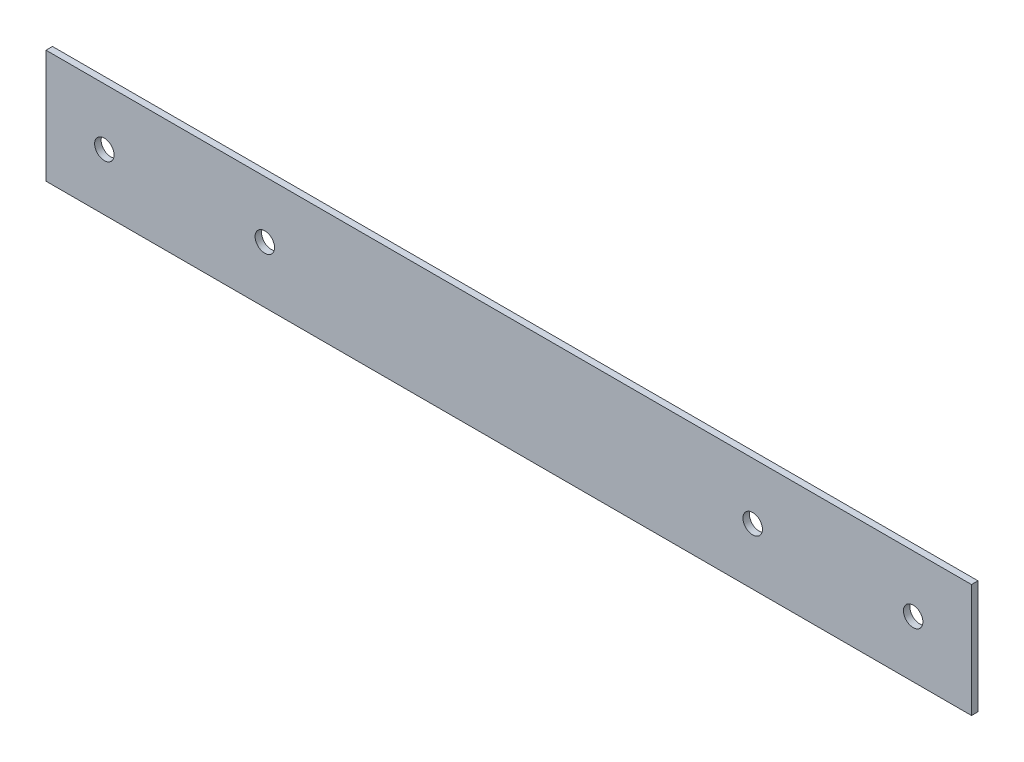
ISO-10303-21;
HEADER;
FILE_DESCRIPTION(('STEP AP214'),'2;1');
FILE_NAME('part.step','',(''),(''),'','','');
FILE_SCHEMA(('AUTOMOTIVE_DESIGN { 1 0 10303 214 1 1 1 1 }'));
ENDSEC;
DATA;
#1=APPLICATION_CONTEXT('core data for automotive mechanical design processes');
#2=APPLICATION_PROTOCOL_DEFINITION('international standard','automotive_design',2000,#1);
#3=PRODUCT_CONTEXT('',#1,'mechanical');
#4=PRODUCT('Part','Part','',(#3));
#5=PRODUCT_RELATED_PRODUCT_CATEGORY('part','',(#4));
#6=PRODUCT_DEFINITION_FORMATION('','',#4);
#7=PRODUCT_DEFINITION_CONTEXT('part definition',#1,'design');
#8=PRODUCT_DEFINITION('design','',#6,#7);
#9=PRODUCT_DEFINITION_SHAPE('','',#8);
#10=(LENGTH_UNIT() NAMED_UNIT(*) SI_UNIT(.MILLI.,.METRE.));
#11=(NAMED_UNIT(*) PLANE_ANGLE_UNIT() SI_UNIT($,.RADIAN.));
#12=(NAMED_UNIT(*) SI_UNIT($,.STERADIAN.) SOLID_ANGLE_UNIT());
#13=UNCERTAINTY_MEASURE_WITH_UNIT(LENGTH_MEASURE(1.E-05),#10,'distance_accuracy_value','');
#14=(GEOMETRIC_REPRESENTATION_CONTEXT(3) GLOBAL_UNCERTAINTY_ASSIGNED_CONTEXT((#13)) GLOBAL_UNIT_ASSIGNED_CONTEXT((#10,
#11,#12)) REPRESENTATION_CONTEXT('',''));
#15=CARTESIAN_POINT('',(0.,0.,0.));
#16=DIRECTION('',(0.,0.,1.));
#17=DIRECTION('',(1.,0.,0.));
#18=AXIS2_PLACEMENT_3D('',#15,#16,#17);
#19=CARTESIAN_POINT('',(0.,0.,2.));
#20=DIRECTION('',(0.,0.,1.));
#21=DIRECTION('',(1.,0.,0.));
#22=AXIS2_PLACEMENT_3D('',#19,#20,#21);
#23=PLANE('',#22);
#24=CARTESIAN_POINT('',(75.25,0.,2.));
#25=DIRECTION('',(0.,0.,1.));
#26=DIRECTION('',(-1.,0.,0.));
#27=AXIS2_PLACEMENT_3D('',#24,#25,#26);
#28=CIRCLE('',#27,3.00000000000001);
#29=CARTESIAN_POINT('',(72.25,0.,2.));
#30=VERTEX_POINT('',#29);
#31=EDGE_CURVE('E120',#30,#30,#28,.T.);
#32=ORIENTED_EDGE('',*,*,#31,.F.);
#33=EDGE_LOOP('',(#32));
#34=FACE_BOUND('',#33,.T.);
#35=CARTESIAN_POINT('',(-124.75,0.,2.));
#36=DIRECTION('',(0.,0.,1.));
#37=DIRECTION('',(1.,0.,0.));
#38=AXIS2_PLACEMENT_3D('',#35,#36,#37);
#39=CIRCLE('',#38,3.00000000000001);
#40=CARTESIAN_POINT('',(-121.75,0.,2.));
#41=VERTEX_POINT('',#40);
#42=EDGE_CURVE('E99',#41,#41,#39,.T.);
#43=ORIENTED_EDGE('',*,*,#42,.F.);
#44=EDGE_LOOP('',(#43));
#45=FACE_BOUND('',#44,.T.);
#46=DIRECTION('',(0.,1.,0.));
#47=VECTOR('',#46,1.);
#48=CARTESIAN_POINT('',(142.75,17.5,2.));
#49=LINE('',#48,#47);
#50=CARTESIAN_POINT('',(142.75,-17.5,2.));
#51=VERTEX_POINT('',#50);
#52=CARTESIAN_POINT('',(142.75,17.5,2.));
#53=VERTEX_POINT('',#52);
#54=EDGE_CURVE('E84',#51,#53,#49,.T.);
#55=ORIENTED_EDGE('',*,*,#54,.T.);
#56=DIRECTION('',(-1.,0.,0.));
#57=VECTOR('',#56,1.);
#58=CARTESIAN_POINT('',(-142.75,17.5,2.));
#59=LINE('',#58,#57);
#60=CARTESIAN_POINT('',(-142.75,17.5,2.));
#61=VERTEX_POINT('',#60);
#62=EDGE_CURVE('E79',#53,#61,#59,.T.);
#63=ORIENTED_EDGE('',*,*,#62,.T.);
#64=DIRECTION('',(0.,-1.,0.));
#65=VECTOR('',#64,1.);
#66=CARTESIAN_POINT('',(-142.75,17.5,2.));
#67=LINE('',#66,#65);
#68=CARTESIAN_POINT('',(-142.75,-17.5,2.));
#69=VERTEX_POINT('',#68);
#70=EDGE_CURVE('E82',#61,#69,#67,.T.);
#71=ORIENTED_EDGE('',*,*,#70,.T.);
#72=DIRECTION('',(1.,0.,0.));
#73=VECTOR('',#72,1.);
#74=CARTESIAN_POINT('',(-142.75,-17.5,2.));
#75=LINE('',#74,#73);
#76=EDGE_CURVE('E49',#69,#51,#75,.T.);
#77=ORIENTED_EDGE('',*,*,#76,.T.);
#78=EDGE_LOOP('',(#55,#63,#71,#77));
#79=FACE_BOUND('',#78,.T.);
#80=CARTESIAN_POINT('',(-75.25,0.,2.));
#81=DIRECTION('',(0.,0.,1.));
#82=DIRECTION('',(1.,0.,0.));
#83=AXIS2_PLACEMENT_3D('',#80,#81,#82);
#84=CIRCLE('',#83,3.00000000000001);
#85=CARTESIAN_POINT('',(-72.25,0.,2.));
#86=VERTEX_POINT('',#85);
#87=EDGE_CURVE('E114',#86,#86,#84,.T.);
#88=ORIENTED_EDGE('',*,*,#87,.F.);
#89=EDGE_LOOP('',(#88));
#90=FACE_BOUND('',#89,.T.);
#91=CARTESIAN_POINT('',(124.75,0.,2.));
#92=DIRECTION('',(0.,0.,1.));
#93=DIRECTION('',(-1.,0.,0.));
#94=AXIS2_PLACEMENT_3D('',#91,#92,#93);
#95=CIRCLE('',#94,3.00000000000001);
#96=CARTESIAN_POINT('',(121.75,0.,2.));
#97=VERTEX_POINT('',#96);
#98=EDGE_CURVE('E126',#97,#97,#95,.T.);
#99=ORIENTED_EDGE('',*,*,#98,.F.);
#100=EDGE_LOOP('',(#99));
#101=FACE_BOUND('',#100,.T.);
#102=ADVANCED_FACE('F32',(#34,#45,#79,#90,#101),#23,.T.);
#103=CARTESIAN_POINT('',(0.,0.,0.));
#104=DIRECTION('',(0.,0.,1.));
#105=DIRECTION('',(1.,0.,0.));
#106=AXIS2_PLACEMENT_3D('',#103,#104,#105);
#107=PLANE('',#106);
#108=DIRECTION('',(0.,1.,0.));
#109=VECTOR('',#108,1.);
#110=CARTESIAN_POINT('',(142.75,17.5,0.));
#111=LINE('',#110,#109);
#112=CARTESIAN_POINT('',(142.75,-17.5,0.));
#113=VERTEX_POINT('',#112);
#114=CARTESIAN_POINT('',(142.75,17.5,0.));
#115=VERTEX_POINT('',#114);
#116=EDGE_CURVE('E96',#113,#115,#111,.T.);
#117=ORIENTED_EDGE('',*,*,#116,.F.);
#118=DIRECTION('',(1.,0.,0.));
#119=VECTOR('',#118,1.);
#120=CARTESIAN_POINT('',(-142.75,-17.5,0.));
#121=LINE('',#120,#119);
#122=CARTESIAN_POINT('',(-142.75,-17.5,0.));
#123=VERTEX_POINT('',#122);
#124=EDGE_CURVE('E72',#123,#113,#121,.T.);
#125=ORIENTED_EDGE('',*,*,#124,.F.);
#126=DIRECTION('',(0.,-1.,0.));
#127=VECTOR('',#126,1.);
#128=CARTESIAN_POINT('',(-142.75,17.5,0.));
#129=LINE('',#128,#127);
#130=CARTESIAN_POINT('',(-142.75,17.5,0.));
#131=VERTEX_POINT('',#130);
#132=EDGE_CURVE('E66',#131,#123,#129,.T.);
#133=ORIENTED_EDGE('',*,*,#132,.F.);
#134=DIRECTION('',(-1.,0.,0.));
#135=VECTOR('',#134,1.);
#136=CARTESIAN_POINT('',(-142.75,17.5,0.));
#137=LINE('',#136,#135);
#138=EDGE_CURVE('E88',#115,#131,#137,.T.);
#139=ORIENTED_EDGE('',*,*,#138,.F.);
#140=EDGE_LOOP('',(#117,#125,#133,#139));
#141=FACE_BOUND('',#140,.T.);
#142=CARTESIAN_POINT('',(-124.75,0.,0.));
#143=DIRECTION('',(0.,0.,1.));
#144=DIRECTION('',(1.,0.,0.));
#145=AXIS2_PLACEMENT_3D('',#142,#143,#144);
#146=CIRCLE('',#145,3.00000000000001);
#147=CARTESIAN_POINT('',(-121.75,0.,0.));
#148=VERTEX_POINT('',#147);
#149=EDGE_CURVE('E111',#148,#148,#146,.T.);
#150=ORIENTED_EDGE('',*,*,#149,.T.);
#151=EDGE_LOOP('',(#150));
#152=FACE_BOUND('',#151,.T.);
#153=CARTESIAN_POINT('',(-75.25,0.,0.));
#154=DIRECTION('',(0.,0.,1.));
#155=DIRECTION('',(1.,0.,0.));
#156=AXIS2_PLACEMENT_3D('',#153,#154,#155);
#157=CIRCLE('',#156,3.00000000000001);
#158=CARTESIAN_POINT('',(-72.25,0.,0.));
#159=VERTEX_POINT('',#158);
#160=EDGE_CURVE('E117',#159,#159,#157,.T.);
#161=ORIENTED_EDGE('',*,*,#160,.T.);
#162=EDGE_LOOP('',(#161));
#163=FACE_BOUND('',#162,.T.);
#164=CARTESIAN_POINT('',(75.25,0.,0.));
#165=DIRECTION('',(0.,0.,1.));
#166=DIRECTION('',(-1.,0.,0.));
#167=AXIS2_PLACEMENT_3D('',#164,#165,#166);
#168=CIRCLE('',#167,3.00000000000001);
#169=CARTESIAN_POINT('',(72.25,0.,0.));
#170=VERTEX_POINT('',#169);
#171=EDGE_CURVE('E123',#170,#170,#168,.T.);
#172=ORIENTED_EDGE('',*,*,#171,.T.);
#173=EDGE_LOOP('',(#172));
#174=FACE_BOUND('',#173,.T.);
#175=CARTESIAN_POINT('',(124.75,0.,0.));
#176=DIRECTION('',(0.,0.,1.));
#177=DIRECTION('',(-1.,0.,0.));
#178=AXIS2_PLACEMENT_3D('',#175,#176,#177);
#179=CIRCLE('',#178,3.00000000000001);
#180=CARTESIAN_POINT('',(121.75,0.,0.));
#181=VERTEX_POINT('',#180);
#182=EDGE_CURVE('E129',#181,#181,#179,.T.);
#183=ORIENTED_EDGE('',*,*,#182,.T.);
#184=EDGE_LOOP('',(#183));
#185=FACE_BOUND('',#184,.T.);
#186=ADVANCED_FACE('F107',(#141,#152,#163,#174,#185),#107,.F.);
#187=CARTESIAN_POINT('',(142.75,17.5,2.));
#188=DIRECTION('',(-1.,0.,0.));
#189=DIRECTION('',(0.,0.,1.));
#190=AXIS2_PLACEMENT_3D('',#187,#188,#189);
#191=PLANE('',#190);
#192=ORIENTED_EDGE('',*,*,#116,.T.);
#193=DIRECTION('',(0.,0.,-1.));
#194=VECTOR('',#193,1.);
#195=CARTESIAN_POINT('',(142.75,17.5,2.));
#196=LINE('',#195,#194);
#197=EDGE_CURVE('E11',#53,#115,#196,.T.);
#198=ORIENTED_EDGE('',*,*,#197,.F.);
#199=ORIENTED_EDGE('',*,*,#54,.F.);
#200=DIRECTION('',(0.,0.,-1.));
#201=VECTOR('',#200,1.);
#202=CARTESIAN_POINT('',(142.75,-17.5,2.));
#203=LINE('',#202,#201);
#204=EDGE_CURVE('E92',#51,#113,#203,.T.);
#205=ORIENTED_EDGE('',*,*,#204,.T.);
#206=EDGE_LOOP('',(#192,#198,#199,#205));
#207=FACE_BOUND('',#206,.T.);
#208=ADVANCED_FACE('F34',(#207),#191,.F.);
#209=CARTESIAN_POINT('',(-142.75,17.5,2.));
#210=DIRECTION('',(0.,-1.,0.));
#211=DIRECTION('',(0.,0.,-1.));
#212=AXIS2_PLACEMENT_3D('',#209,#210,#211);
#213=PLANE('',#212);
#214=ORIENTED_EDGE('',*,*,#138,.T.);
#215=DIRECTION('',(0.,0.,-1.));
#216=VECTOR('',#215,1.);
#217=CARTESIAN_POINT('',(-142.75,17.5,2.));
#218=LINE('',#217,#216);
#219=EDGE_CURVE('E41',#61,#131,#218,.T.);
#220=ORIENTED_EDGE('',*,*,#219,.F.);
#221=ORIENTED_EDGE('',*,*,#62,.F.);
#222=ORIENTED_EDGE('',*,*,#197,.T.);
#223=EDGE_LOOP('',(#214,#220,#221,#222));
#224=FACE_BOUND('',#223,.T.);
#225=ADVANCED_FACE('F87',(#224),#213,.F.);
#226=CARTESIAN_POINT('',(-142.75,17.5,2.));
#227=DIRECTION('',(1.,0.,0.));
#228=DIRECTION('',(0.,0.,-1.));
#229=AXIS2_PLACEMENT_3D('',#226,#227,#228);
#230=PLANE('',#229);
#231=ORIENTED_EDGE('',*,*,#132,.T.);
#232=DIRECTION('',(0.,0.,-1.));
#233=VECTOR('',#232,1.);
#234=CARTESIAN_POINT('',(-142.75,-17.5,2.));
#235=LINE('',#234,#233);
#236=EDGE_CURVE('E89',#69,#123,#235,.T.);
#237=ORIENTED_EDGE('',*,*,#236,.F.);
#238=ORIENTED_EDGE('',*,*,#70,.F.);
#239=ORIENTED_EDGE('',*,*,#219,.T.);
#240=EDGE_LOOP('',(#231,#237,#238,#239));
#241=FACE_BOUND('',#240,.T.);
#242=ADVANCED_FACE('F90',(#241),#230,.F.);
#243=CARTESIAN_POINT('',(-142.75,-17.5,2.));
#244=DIRECTION('',(0.,1.,0.));
#245=DIRECTION('',(0.,0.,1.));
#246=AXIS2_PLACEMENT_3D('',#243,#244,#245);
#247=PLANE('',#246);
#248=ORIENTED_EDGE('',*,*,#124,.T.);
#249=ORIENTED_EDGE('',*,*,#204,.F.);
#250=ORIENTED_EDGE('',*,*,#76,.F.);
#251=ORIENTED_EDGE('',*,*,#236,.T.);
#252=EDGE_LOOP('',(#248,#249,#250,#251));
#253=FACE_BOUND('',#252,.T.);
#254=ADVANCED_FACE('F104',(#253),#247,.F.);
#255=CARTESIAN_POINT('',(-124.75,0.,2.));
#256=DIRECTION('',(0.,0.,-1.));
#257=DIRECTION('',(-1.,0.,0.));
#258=AXIS2_PLACEMENT_3D('',#255,#256,#257);
#259=CYLINDRICAL_SURFACE('',#258,3.00000000000001);
#260=ORIENTED_EDGE('',*,*,#42,.T.);
#261=EDGE_LOOP('',(#260));
#262=FACE_BOUND('',#261,.T.);
#263=ORIENTED_EDGE('',*,*,#149,.F.);
#264=EDGE_LOOP('',(#263));
#265=FACE_BOUND('',#264,.T.);
#266=ADVANCED_FACE('F148',(#262,#265),#259,.F.);
#267=CARTESIAN_POINT('',(-75.25,0.,2.));
#268=DIRECTION('',(0.,0.,-1.));
#269=DIRECTION('',(-1.,0.,0.));
#270=AXIS2_PLACEMENT_3D('',#267,#268,#269);
#271=CYLINDRICAL_SURFACE('',#270,3.00000000000001);
#272=ORIENTED_EDGE('',*,*,#87,.T.);
#273=EDGE_LOOP('',(#272));
#274=FACE_BOUND('',#273,.T.);
#275=ORIENTED_EDGE('',*,*,#160,.F.);
#276=EDGE_LOOP('',(#275));
#277=FACE_BOUND('',#276,.T.);
#278=ADVANCED_FACE('F194',(#274,#277),#271,.F.);
#279=CARTESIAN_POINT('',(75.25,0.,2.));
#280=DIRECTION('',(0.,0.,-1.));
#281=DIRECTION('',(-1.,0.,0.));
#282=AXIS2_PLACEMENT_3D('',#279,#280,#281);
#283=CYLINDRICAL_SURFACE('',#282,3.00000000000001);
#284=ORIENTED_EDGE('',*,*,#31,.T.);
#285=EDGE_LOOP('',(#284));
#286=FACE_BOUND('',#285,.T.);
#287=ORIENTED_EDGE('',*,*,#171,.F.);
#288=EDGE_LOOP('',(#287));
#289=FACE_BOUND('',#288,.T.);
#290=ADVANCED_FACE('F202',(#286,#289),#283,.F.);
#291=CARTESIAN_POINT('',(124.75,0.,2.));
#292=DIRECTION('',(0.,0.,-1.));
#293=DIRECTION('',(-1.,0.,0.));
#294=AXIS2_PLACEMENT_3D('',#291,#292,#293);
#295=CYLINDRICAL_SURFACE('',#294,3.00000000000001);
#296=ORIENTED_EDGE('',*,*,#98,.T.);
#297=EDGE_LOOP('',(#296));
#298=FACE_BOUND('',#297,.T.);
#299=ORIENTED_EDGE('',*,*,#182,.F.);
#300=EDGE_LOOP('',(#299));
#301=FACE_BOUND('',#300,.T.);
#302=ADVANCED_FACE('F135',(#298,#301),#295,.F.);
#303=CLOSED_SHELL('',(#102,#186,#208,#225,#242,#254,#266,#278,#290,#302));
#304=MANIFOLD_SOLID_BREP('B2',#303);
#305=ADVANCED_BREP_SHAPE_REPRESENTATION('',(#18,#304),#14);
#306=SHAPE_DEFINITION_REPRESENTATION(#9,#305);
ENDSEC;
END-ISO-10303-21;
